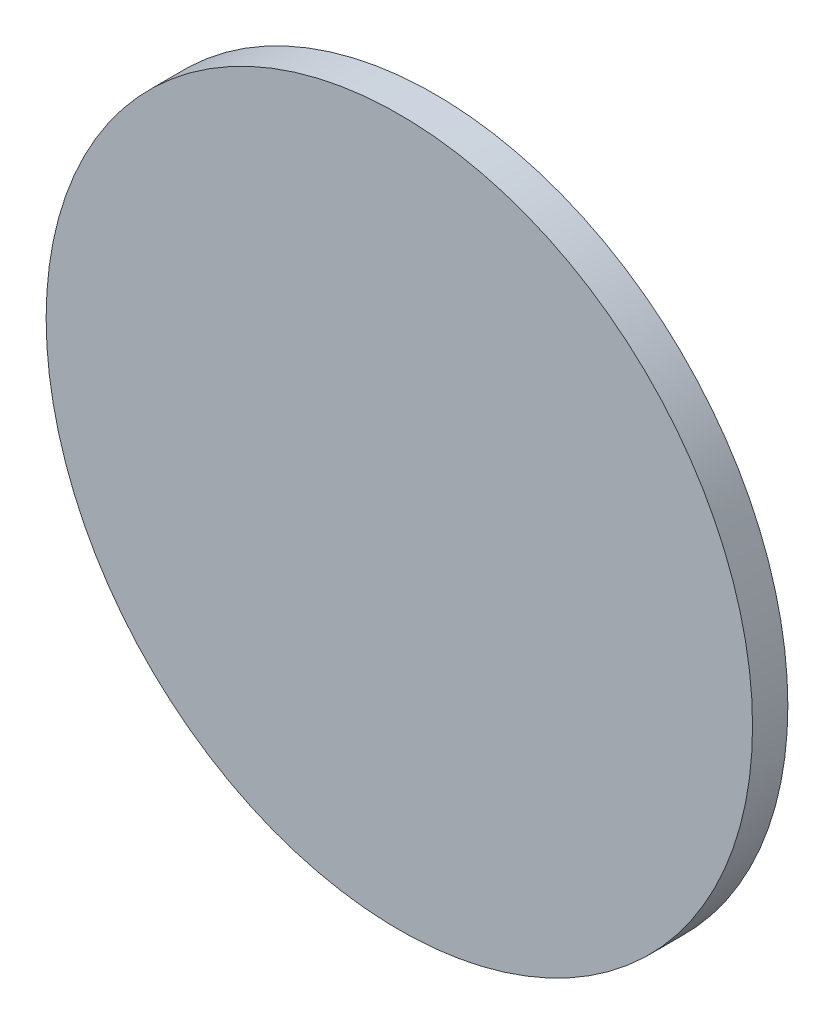
ISO-10303-21;
HEADER;
FILE_DESCRIPTION(('STEP AP214'),'2;1');
FILE_NAME('part.step','',(''),(''),'','','');
FILE_SCHEMA(('AUTOMOTIVE_DESIGN { 1 0 10303 214 1 1 1 1 }'));
ENDSEC;
DATA;
#1=APPLICATION_CONTEXT('core data for automotive mechanical design processes');
#2=APPLICATION_PROTOCOL_DEFINITION('international standard','automotive_design',2000,#1);
#3=PRODUCT_CONTEXT('',#1,'mechanical');
#4=PRODUCT('Part','Part','',(#3));
#5=PRODUCT_RELATED_PRODUCT_CATEGORY('part','',(#4));
#6=PRODUCT_DEFINITION_FORMATION('','',#4);
#7=PRODUCT_DEFINITION_CONTEXT('part definition',#1,'design');
#8=PRODUCT_DEFINITION('design','',#6,#7);
#9=PRODUCT_DEFINITION_SHAPE('','',#8);
#10=(LENGTH_UNIT() NAMED_UNIT(*) SI_UNIT(.MILLI.,.METRE.));
#11=(NAMED_UNIT(*) PLANE_ANGLE_UNIT() SI_UNIT($,.RADIAN.));
#12=(NAMED_UNIT(*) SI_UNIT($,.STERADIAN.) SOLID_ANGLE_UNIT());
#13=UNCERTAINTY_MEASURE_WITH_UNIT(LENGTH_MEASURE(1.E-05),#10,'distance_accuracy_value','');
#14=(GEOMETRIC_REPRESENTATION_CONTEXT(3) GLOBAL_UNCERTAINTY_ASSIGNED_CONTEXT((#13)) GLOBAL_UNIT_ASSIGNED_CONTEXT((#10,
#11,#12)) REPRESENTATION_CONTEXT('',''));
#15=CARTESIAN_POINT('',(0.,0.,0.));
#16=DIRECTION('',(0.,0.,1.));
#17=DIRECTION('',(1.,0.,0.));
#18=AXIS2_PLACEMENT_3D('',#15,#16,#17);
#19=CARTESIAN_POINT('',(0.,0.,2.));
#20=DIRECTION('',(0.,0.,-1.));
#21=DIRECTION('',(-1.,0.,0.));
#22=AXIS2_PLACEMENT_3D('',#19,#20,#21);
#23=CYLINDRICAL_SURFACE('',#22,20.);
#24=CARTESIAN_POINT('',(0.,0.,2.));
#25=DIRECTION('',(0.,0.,1.));
#26=DIRECTION('',(1.,0.,0.));
#27=AXIS2_PLACEMENT_3D('',#24,#25,#26);
#28=CIRCLE('',#27,20.);
#29=CARTESIAN_POINT('',(20.,0.,2.));
#30=VERTEX_POINT('',#29);
#31=EDGE_CURVE('E10',#30,#30,#28,.T.);
#32=ORIENTED_EDGE('',*,*,#31,.F.);
#33=EDGE_LOOP('',(#32));
#34=FACE_BOUND('',#33,.T.);
#35=CARTESIAN_POINT('',(0.,0.,0.));
#36=DIRECTION('',(0.,0.,1.));
#37=DIRECTION('',(1.,0.,0.));
#38=AXIS2_PLACEMENT_3D('',#35,#36,#37);
#39=CIRCLE('',#38,20.);
#40=CARTESIAN_POINT('',(20.,0.,0.));
#41=VERTEX_POINT('',#40);
#42=EDGE_CURVE('E38',#41,#41,#39,.T.);
#43=ORIENTED_EDGE('',*,*,#42,.T.);
#44=EDGE_LOOP('',(#43));
#45=FACE_BOUND('',#44,.T.);
#46=ADVANCED_FACE('F35',(#34,#45),#23,.T.);
#47=CARTESIAN_POINT('',(0.,0.,2.));
#48=DIRECTION('',(0.,0.,1.));
#49=DIRECTION('',(1.,0.,0.));
#50=AXIS2_PLACEMENT_3D('',#47,#48,#49);
#51=PLANE('',#50);
#52=ORIENTED_EDGE('',*,*,#31,.T.);
#53=EDGE_LOOP('',(#52));
#54=FACE_BOUND('',#53,.T.);
#55=ADVANCED_FACE('F50',(#54),#51,.T.);
#56=CARTESIAN_POINT('',(0.,0.,0.));
#57=DIRECTION('',(0.,0.,1.));
#58=DIRECTION('',(1.,0.,0.));
#59=AXIS2_PLACEMENT_3D('',#56,#57,#58);
#60=PLANE('',#59);
#61=ORIENTED_EDGE('',*,*,#42,.F.);
#62=EDGE_LOOP('',(#61));
#63=FACE_BOUND('',#62,.T.);
#64=ADVANCED_FACE('F48',(#63),#60,.F.);
#65=CLOSED_SHELL('',(#46,#55,#64));
#66=MANIFOLD_SOLID_BREP('B2',#65);
#67=ADVANCED_BREP_SHAPE_REPRESENTATION('',(#18,#66),#14);
#68=SHAPE_DEFINITION_REPRESENTATION(#9,#67);
ENDSEC;
END-ISO-10303-21;
